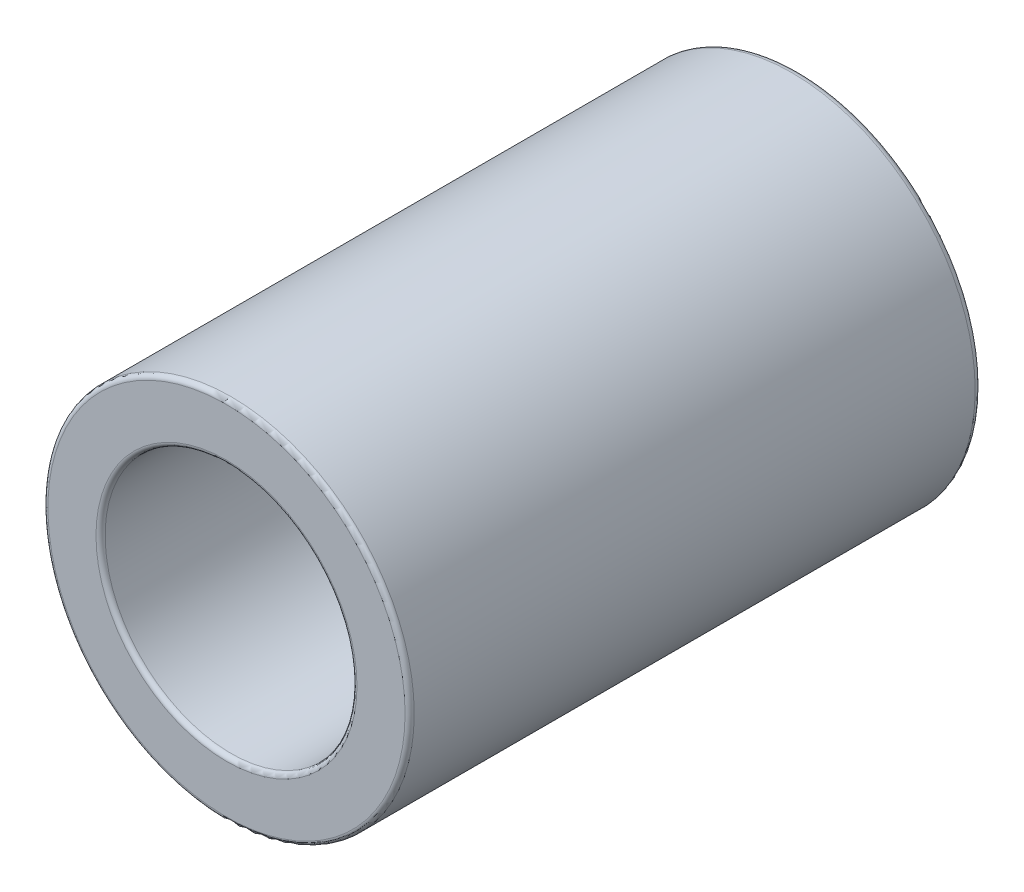
ISO-10303-21;
HEADER;
FILE_DESCRIPTION(('STEP AP214'),'2;1');
FILE_NAME('part.step','',(''),(''),'','','');
FILE_SCHEMA(('AUTOMOTIVE_DESIGN { 1 0 10303 214 1 1 1 1 }'));
ENDSEC;
DATA;
#1=APPLICATION_CONTEXT('core data for automotive mechanical design processes');
#2=APPLICATION_PROTOCOL_DEFINITION('international standard','automotive_design',2000,#1);
#3=PRODUCT_CONTEXT('',#1,'mechanical');
#4=PRODUCT('Part','Part','',(#3));
#5=PRODUCT_RELATED_PRODUCT_CATEGORY('part','',(#4));
#6=PRODUCT_DEFINITION_FORMATION('','',#4);
#7=PRODUCT_DEFINITION_CONTEXT('part definition',#1,'design');
#8=PRODUCT_DEFINITION('design','',#6,#7);
#9=PRODUCT_DEFINITION_SHAPE('','',#8);
#10=(LENGTH_UNIT() NAMED_UNIT(*) SI_UNIT(.MILLI.,.METRE.));
#11=(NAMED_UNIT(*) PLANE_ANGLE_UNIT() SI_UNIT($,.RADIAN.));
#12=(NAMED_UNIT(*) SI_UNIT($,.STERADIAN.) SOLID_ANGLE_UNIT());
#13=UNCERTAINTY_MEASURE_WITH_UNIT(LENGTH_MEASURE(1.E-05),#10,'distance_accuracy_value','');
#14=(GEOMETRIC_REPRESENTATION_CONTEXT(3) GLOBAL_UNCERTAINTY_ASSIGNED_CONTEXT((#13)) GLOBAL_UNIT_ASSIGNED_CONTEXT((#10,
#11,#12)) REPRESENTATION_CONTEXT('',''));
#15=CARTESIAN_POINT('',(0.,0.,0.));
#16=DIRECTION('',(0.,0.,1.));
#17=DIRECTION('',(1.,0.,0.));
#18=AXIS2_PLACEMENT_3D('',#15,#16,#17);
#19=CARTESIAN_POINT('',(0.,0.,25.));
#20=DIRECTION('',(0.,0.,-1.));
#21=DIRECTION('',(-1.,0.,0.));
#22=AXIS2_PLACEMENT_3D('',#19,#20,#21);
#23=CYLINDRICAL_SURFACE('',#22,8.);
#24=CARTESIAN_POINT('',(0.,0.,0.300000000000002));
#25=DIRECTION('',(0.,0.,1.));
#26=DIRECTION('',(1.,0.,0.));
#27=AXIS2_PLACEMENT_3D('',#24,#25,#26);
#28=CIRCLE('',#27,8.);
#29=CARTESIAN_POINT('',(8.,0.,0.300000000000002));
#30=VERTEX_POINT('',#29);
#31=EDGE_CURVE('E41',#30,#30,#28,.T.);
#32=ORIENTED_EDGE('',*,*,#31,.T.);
#33=EDGE_LOOP('',(#32));
#34=FACE_BOUND('',#33,.T.);
#35=CARTESIAN_POINT('',(0.,0.,24.8));
#36=DIRECTION('',(0.,0.,1.));
#37=DIRECTION('',(1.,0.,0.));
#38=AXIS2_PLACEMENT_3D('',#35,#36,#37);
#39=CIRCLE('',#38,8.);
#40=CARTESIAN_POINT('',(8.,0.,24.8));
#41=VERTEX_POINT('',#40);
#42=EDGE_CURVE('E49',#41,#41,#39,.F.);
#43=ORIENTED_EDGE('',*,*,#42,.T.);
#44=EDGE_LOOP('',(#43));
#45=FACE_BOUND('',#44,.T.);
#46=ADVANCED_FACE('F34',(#34,#45),#23,.T.);
#47=CARTESIAN_POINT('',(0.,0.,25.));
#48=DIRECTION('',(0.,0.,1.));
#49=DIRECTION('',(1.,0.,0.));
#50=AXIS2_PLACEMENT_3D('',#47,#48,#49);
#51=PLANE('',#50);
#52=CARTESIAN_POINT('',(0.,0.,25.));
#53=DIRECTION('',(0.,0.,1.));
#54=DIRECTION('',(1.,0.,0.));
#55=AXIS2_PLACEMENT_3D('',#52,#53,#54);
#56=CIRCLE('',#55,7.8);
#57=CARTESIAN_POINT('',(7.8,0.,25.));
#58=VERTEX_POINT('',#57);
#59=EDGE_CURVE('E54',#58,#58,#56,.T.);
#60=ORIENTED_EDGE('',*,*,#59,.T.);
#61=EDGE_LOOP('',(#60));
#62=FACE_BOUND('',#61,.T.);
#63=CARTESIAN_POINT('',(0.,0.,25.));
#64=DIRECTION('',(0.,0.,1.));
#65=DIRECTION('',(1.,0.,0.));
#66=AXIS2_PLACEMENT_3D('',#63,#64,#65);
#67=CIRCLE('',#66,5.7);
#68=CARTESIAN_POINT('',(5.7,0.,25.));
#69=VERTEX_POINT('',#68);
#70=EDGE_CURVE('E57',#69,#69,#67,.F.);
#71=ORIENTED_EDGE('',*,*,#70,.T.);
#72=EDGE_LOOP('',(#71));
#73=FACE_BOUND('',#72,.T.);
#74=ADVANCED_FACE('F90',(#62,#73),#51,.T.);
#75=CARTESIAN_POINT('',(0.,0.,0.));
#76=DIRECTION('',(0.,0.,1.));
#77=DIRECTION('',(1.,0.,0.));
#78=AXIS2_PLACEMENT_3D('',#75,#76,#77);
#79=PLANE('',#78);
#80=CARTESIAN_POINT('',(0.,0.,0.));
#81=DIRECTION('',(0.,0.,1.));
#82=DIRECTION('',(1.,0.,0.));
#83=AXIS2_PLACEMENT_3D('',#80,#81,#82);
#84=CIRCLE('',#83,7.7);
#85=CARTESIAN_POINT('',(7.7,0.,0.));
#86=VERTEX_POINT('',#85);
#87=EDGE_CURVE('E10',#86,#86,#84,.F.);
#88=ORIENTED_EDGE('',*,*,#87,.T.);
#89=EDGE_LOOP('',(#88));
#90=FACE_BOUND('',#89,.T.);
#91=CARTESIAN_POINT('',(0.,0.,0.));
#92=DIRECTION('',(0.,0.,1.));
#93=DIRECTION('',(1.,0.,0.));
#94=AXIS2_PLACEMENT_3D('',#91,#92,#93);
#95=CIRCLE('',#94,2.7);
#96=CARTESIAN_POINT('',(2.7,0.,0.));
#97=VERTEX_POINT('',#96);
#98=EDGE_CURVE('E69',#97,#97,#95,.T.);
#99=ORIENTED_EDGE('',*,*,#98,.T.);
#100=EDGE_LOOP('',(#99));
#101=FACE_BOUND('',#100,.T.);
#102=ADVANCED_FACE('F80',(#90,#101),#79,.F.);
#103=CARTESIAN_POINT('',(0.,0.,5.));
#104=DIRECTION('',(0.,0.,1.));
#105=DIRECTION('',(1.,0.,0.));
#106=AXIS2_PLACEMENT_3D('',#103,#104,#105);
#107=CYLINDRICAL_SURFACE('',#106,5.5);
#108=CARTESIAN_POINT('',(0.,0.,24.8));
#109=DIRECTION('',(0.,0.,1.));
#110=DIRECTION('',(1.,0.,0.));
#111=AXIS2_PLACEMENT_3D('',#108,#109,#110);
#112=CIRCLE('',#111,5.5);
#113=CARTESIAN_POINT('',(5.5,0.,24.8));
#114=VERTEX_POINT('',#113);
#115=EDGE_CURVE('E45',#114,#114,#112,.T.);
#116=ORIENTED_EDGE('',*,*,#115,.T.);
#117=EDGE_LOOP('',(#116));
#118=FACE_BOUND('',#117,.T.);
#119=CARTESIAN_POINT('',(0.,0.,5.));
#120=DIRECTION('',(0.,0.,1.));
#121=DIRECTION('',(1.,0.,0.));
#122=AXIS2_PLACEMENT_3D('',#119,#120,#121);
#123=CIRCLE('',#122,5.5);
#124=CARTESIAN_POINT('',(5.5,0.,5.));
#125=VERTEX_POINT('',#124);
#126=EDGE_CURVE('E72',#125,#125,#123,.T.);
#127=ORIENTED_EDGE('',*,*,#126,.F.);
#128=EDGE_LOOP('',(#127));
#129=FACE_BOUND('',#128,.T.);
#130=ADVANCED_FACE('F78',(#118,#129),#107,.F.);
#131=CARTESIAN_POINT('',(0.,0.,5.));
#132=DIRECTION('',(0.,0.,1.));
#133=DIRECTION('',(1.,0.,0.));
#134=AXIS2_PLACEMENT_3D('',#131,#132,#133);
#135=PLANE('',#134);
#136=CARTESIAN_POINT('',(0.,0.,5.));
#137=DIRECTION('',(0.,0.,1.));
#138=DIRECTION('',(1.,0.,0.));
#139=AXIS2_PLACEMENT_3D('',#136,#137,#138);
#140=CIRCLE('',#139,2.7);
#141=CARTESIAN_POINT('',(2.7,0.,5.));
#142=VERTEX_POINT('',#141);
#143=EDGE_CURVE('E60',#142,#142,#140,.F.);
#144=ORIENTED_EDGE('',*,*,#143,.T.);
#145=EDGE_LOOP('',(#144));
#146=FACE_BOUND('',#145,.T.);
#147=ORIENTED_EDGE('',*,*,#126,.T.);
#148=EDGE_LOOP('',(#147));
#149=FACE_BOUND('',#148,.T.);
#150=ADVANCED_FACE('F76',(#146,#149),#135,.T.);
#151=CARTESIAN_POINT('',(0.,0.,0.));
#152=DIRECTION('',(0.,0.,1.));
#153=DIRECTION('',(1.,0.,0.));
#154=AXIS2_PLACEMENT_3D('',#151,#152,#153);
#155=CYLINDRICAL_SURFACE('',#154,2.5);
#156=CARTESIAN_POINT('',(0.,0.,0.2));
#157=DIRECTION('',(0.,0.,1.));
#158=DIRECTION('',(1.,0.,0.));
#159=AXIS2_PLACEMENT_3D('',#156,#157,#158);
#160=CIRCLE('',#159,2.5);
#161=CARTESIAN_POINT('',(2.5,0.,0.2));
#162=VERTEX_POINT('',#161);
#163=EDGE_CURVE('E63',#162,#162,#160,.F.);
#164=ORIENTED_EDGE('',*,*,#163,.T.);
#165=EDGE_LOOP('',(#164));
#166=FACE_BOUND('',#165,.T.);
#167=CARTESIAN_POINT('',(0.,0.,4.8));
#168=DIRECTION('',(0.,0.,1.));
#169=DIRECTION('',(1.,0.,0.));
#170=AXIS2_PLACEMENT_3D('',#167,#168,#169);
#171=CIRCLE('',#170,2.5);
#172=CARTESIAN_POINT('',(2.5,0.,4.8));
#173=VERTEX_POINT('',#172);
#174=EDGE_CURVE('E66',#173,#173,#171,.T.);
#175=ORIENTED_EDGE('',*,*,#174,.T.);
#176=EDGE_LOOP('',(#175));
#177=FACE_BOUND('',#176,.T.);
#178=ADVANCED_FACE('F87',(#166,#177),#155,.F.);
#179=CARTESIAN_POINT('',(0.,0.,0.2));
#180=DIRECTION('',(0.,0.,1.));
#181=DIRECTION('',(1.,0.,0.));
#182=AXIS2_PLACEMENT_3D('',#179,#180,#181);
#183=TOROIDAL_SURFACE('',#182,2.7,0.2);
#184=ORIENTED_EDGE('',*,*,#163,.F.);
#185=EDGE_LOOP('',(#184));
#186=FACE_BOUND('',#185,.T.);
#187=ORIENTED_EDGE('',*,*,#98,.F.);
#188=EDGE_LOOP('',(#187));
#189=FACE_BOUND('',#188,.T.);
#190=ADVANCED_FACE('F101',(#186,#189),#183,.T.);
#191=CARTESIAN_POINT('',(0.,0.,4.8));
#192=DIRECTION('',(0.,0.,1.));
#193=DIRECTION('',(1.,0.,0.));
#194=AXIS2_PLACEMENT_3D('',#191,#192,#193);
#195=TOROIDAL_SURFACE('',#194,2.7,0.2);
#196=ORIENTED_EDGE('',*,*,#143,.F.);
#197=EDGE_LOOP('',(#196));
#198=FACE_BOUND('',#197,.T.);
#199=ORIENTED_EDGE('',*,*,#174,.F.);
#200=EDGE_LOOP('',(#199));
#201=FACE_BOUND('',#200,.T.);
#202=ADVANCED_FACE('F104',(#198,#201),#195,.T.);
#203=CARTESIAN_POINT('',(0.,0.,24.8));
#204=DIRECTION('',(0.,0.,1.));
#205=DIRECTION('',(1.,0.,0.));
#206=AXIS2_PLACEMENT_3D('',#203,#204,#205);
#207=TOROIDAL_SURFACE('',#206,7.8,0.2);
#208=ORIENTED_EDGE('',*,*,#42,.F.);
#209=EDGE_LOOP('',(#208));
#210=FACE_BOUND('',#209,.T.);
#211=ORIENTED_EDGE('',*,*,#59,.F.);
#212=EDGE_LOOP('',(#211));
#213=FACE_BOUND('',#212,.T.);
#214=ADVANCED_FACE('F108',(#210,#213),#207,.T.);
#215=CARTESIAN_POINT('',(0.,0.,24.8));
#216=DIRECTION('',(0.,0.,1.));
#217=DIRECTION('',(1.,0.,0.));
#218=AXIS2_PLACEMENT_3D('',#215,#216,#217);
#219=TOROIDAL_SURFACE('',#218,5.7,0.2);
#220=ORIENTED_EDGE('',*,*,#70,.F.);
#221=EDGE_LOOP('',(#220));
#222=FACE_BOUND('',#221,.T.);
#223=ORIENTED_EDGE('',*,*,#115,.F.);
#224=EDGE_LOOP('',(#223));
#225=FACE_BOUND('',#224,.T.);
#226=ADVANCED_FACE('F111',(#222,#225),#219,.T.);
#227=CARTESIAN_POINT('',(0.,0.,0.300000000000002));
#228=DIRECTION('',(0.,0.,1.));
#229=DIRECTION('',(1.,0.,0.));
#230=AXIS2_PLACEMENT_3D('',#227,#228,#229);
#231=TOROIDAL_SURFACE('',#230,7.7,0.3);
#232=ORIENTED_EDGE('',*,*,#87,.F.);
#233=EDGE_LOOP('',(#232));
#234=FACE_BOUND('',#233,.T.);
#235=ORIENTED_EDGE('',*,*,#31,.F.);
#236=EDGE_LOOP('',(#235));
#237=FACE_BOUND('',#236,.T.);
#238=ADVANCED_FACE('F36',(#234,#237),#231,.T.);
#239=CLOSED_SHELL('',(#46,#74,#102,#130,#150,#178,#190,#202,#214,#226,#238));
#240=MANIFOLD_SOLID_BREP('B2',#239);
#241=ADVANCED_BREP_SHAPE_REPRESENTATION('',(#18,#240),#14);
#242=SHAPE_DEFINITION_REPRESENTATION(#9,#241);
ENDSEC;
END-ISO-10303-21;
